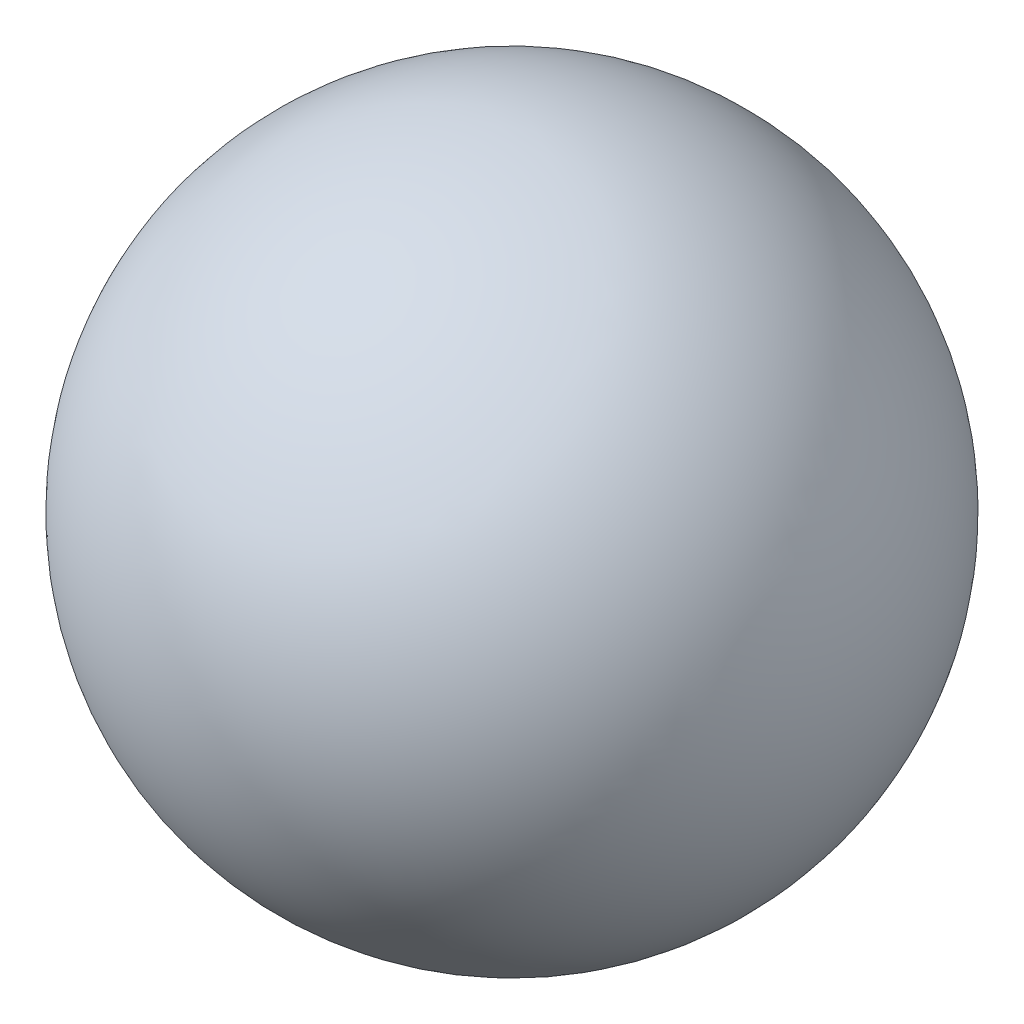
ISO-10303-21;
HEADER;
FILE_DESCRIPTION(('STEP AP214'),'2;1');
FILE_NAME('part.step','',(''),(''),'','','');
FILE_SCHEMA(('AUTOMOTIVE_DESIGN { 1 0 10303 214 1 1 1 1 }'));
ENDSEC;
DATA;
#1=APPLICATION_CONTEXT('core data for automotive mechanical design processes');
#2=APPLICATION_PROTOCOL_DEFINITION('international standard','automotive_design',2000,#1);
#3=PRODUCT_CONTEXT('',#1,'mechanical');
#4=PRODUCT('Part','Part','',(#3));
#5=PRODUCT_RELATED_PRODUCT_CATEGORY('part','',(#4));
#6=PRODUCT_DEFINITION_FORMATION('','',#4);
#7=PRODUCT_DEFINITION_CONTEXT('part definition',#1,'design');
#8=PRODUCT_DEFINITION('design','',#6,#7);
#9=PRODUCT_DEFINITION_SHAPE('','',#8);
#10=(LENGTH_UNIT() NAMED_UNIT(*) SI_UNIT(.MILLI.,.METRE.));
#11=(NAMED_UNIT(*) PLANE_ANGLE_UNIT() SI_UNIT($,.RADIAN.));
#12=(NAMED_UNIT(*) SI_UNIT($,.STERADIAN.) SOLID_ANGLE_UNIT());
#13=UNCERTAINTY_MEASURE_WITH_UNIT(LENGTH_MEASURE(1.E-05),#10,'distance_accuracy_value','');
#14=(GEOMETRIC_REPRESENTATION_CONTEXT(3) GLOBAL_UNCERTAINTY_ASSIGNED_CONTEXT((#13)) GLOBAL_UNIT_ASSIGNED_CONTEXT((#10,
#11,#12)) REPRESENTATION_CONTEXT('',''));
#15=CARTESIAN_POINT('',(0.,0.,0.));
#16=DIRECTION('',(0.,0.,1.));
#17=DIRECTION('',(1.,0.,0.));
#18=AXIS2_PLACEMENT_3D('',#15,#16,#17);
#19=CARTESIAN_POINT('',(0.,0.,0.));
#20=DIRECTION('',(-1.,0.,0.));
#21=DIRECTION('',(0.,-1.,0.));
#22=AXIS2_PLACEMENT_3D('',#19,#20,#21);
#23=SPHERICAL_SURFACE('',#22,12.);
#24=CARTESIAN_POINT('',(-12.,0.,0.));
#25=VERTEX_POINT('',#24);
#26=VERTEX_LOOP('',#25);
#27=FACE_BOUND('',#26,.T.);
#28=ADVANCED_FACE('F33',(#27),#23,.T.);
#29=CLOSED_SHELL('',(#28));
#30=MANIFOLD_SOLID_BREP('B2',#29);
#31=ADVANCED_BREP_SHAPE_REPRESENTATION('',(#18,#30),#14);
#32=SHAPE_DEFINITION_REPRESENTATION(#9,#31);
ENDSEC;
END-ISO-10303-21;
